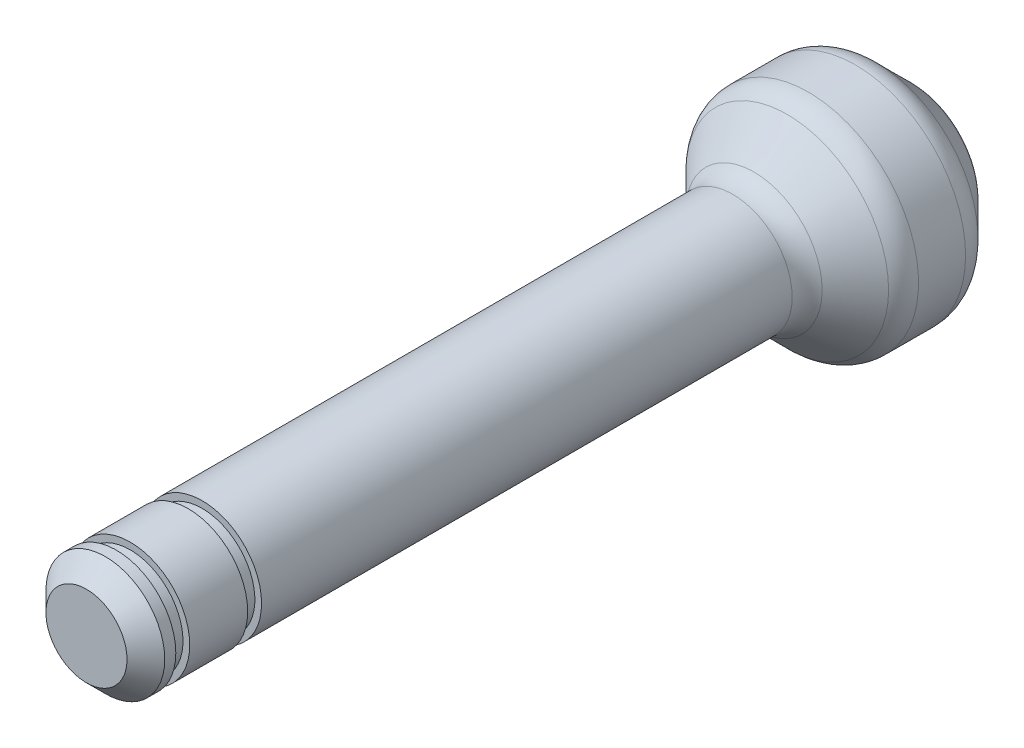
ISO-10303-21;
HEADER;
FILE_DESCRIPTION(('STEP AP214'),'2;1');
FILE_NAME('part.step','',(''),(''),'','','');
FILE_SCHEMA(('AUTOMOTIVE_DESIGN { 1 0 10303 214 1 1 1 1 }'));
ENDSEC;
DATA;
#1=APPLICATION_CONTEXT('core data for automotive mechanical design processes');
#2=APPLICATION_PROTOCOL_DEFINITION('international standard','automotive_design',2000,#1);
#3=PRODUCT_CONTEXT('',#1,'mechanical');
#4=PRODUCT('Part','Part','',(#3));
#5=PRODUCT_RELATED_PRODUCT_CATEGORY('part','',(#4));
#6=PRODUCT_DEFINITION_FORMATION('','',#4);
#7=PRODUCT_DEFINITION_CONTEXT('part definition',#1,'design');
#8=PRODUCT_DEFINITION('design','',#6,#7);
#9=PRODUCT_DEFINITION_SHAPE('','',#8);
#10=(LENGTH_UNIT() NAMED_UNIT(*) SI_UNIT(.MILLI.,.METRE.));
#11=(NAMED_UNIT(*) PLANE_ANGLE_UNIT() SI_UNIT($,.RADIAN.));
#12=(NAMED_UNIT(*) SI_UNIT($,.STERADIAN.) SOLID_ANGLE_UNIT());
#13=UNCERTAINTY_MEASURE_WITH_UNIT(LENGTH_MEASURE(1.E-05),#10,'distance_accuracy_value','');
#14=(GEOMETRIC_REPRESENTATION_CONTEXT(3) GLOBAL_UNCERTAINTY_ASSIGNED_CONTEXT((#13)) GLOBAL_UNIT_ASSIGNED_CONTEXT((#10,
#11,#12)) REPRESENTATION_CONTEXT('',''));
#15=CARTESIAN_POINT('',(0.,0.,0.));
#16=DIRECTION('',(0.,0.,1.));
#17=DIRECTION('',(1.,0.,0.));
#18=AXIS2_PLACEMENT_3D('',#15,#16,#17);
#19=CARTESIAN_POINT('',(0.,3.1496,39.5224));
#20=DIRECTION('',(0.,0.,-1.));
#21=DIRECTION('',(1.,0.,0.));
#22=AXIS2_PLACEMENT_3D('',#19,#20,#21);
#23=PLANE('',#22);
#24=CARTESIAN_POINT('',(0.,0.,39.522399999953));
#25=DIRECTION('',(0.,0.,1.));
#26=DIRECTION('',(1.,0.,0.));
#27=AXIS2_PLACEMENT_3D('',#24,#25,#26);
#28=CIRCLE('',#27,2.14959999988196);
#29=CARTESIAN_POINT('',(2.14959999988196,0.,39.522399999953));
#30=VERTEX_POINT('',#29);
#31=EDGE_CURVE('E119',#30,#30,#28,.T.);
#32=ORIENTED_EDGE('',*,*,#31,.T.);
#33=EDGE_LOOP('',(#32));
#34=FACE_BOUND('',#33,.T.);
#35=ADVANCED_FACE('F37',(#34),#23,.F.);
#36=CARTESIAN_POINT('',(0.,0.,38.5223999999766));
#37=DIRECTION('',(0.,0.,-1.));
#38=DIRECTION('',(1.,0.,0.));
#39=AXIS2_PLACEMENT_3D('',#36,#37,#38);
#40=CONICAL_SURFACE('',#39,3.14959999985831,0.785398163397448);
#41=ORIENTED_EDGE('',*,*,#31,.F.);
#42=EDGE_LOOP('',(#41));
#43=FACE_BOUND('',#42,.T.);
#44=CARTESIAN_POINT('',(0.,0.,38.5224));
#45=DIRECTION('',(0.,0.,1.));
#46=DIRECTION('',(1.,0.,0.));
#47=AXIS2_PLACEMENT_3D('',#44,#45,#46);
#48=CIRCLE('',#47,3.1496);
#49=CARTESIAN_POINT('',(3.1496,0.,38.5224));
#50=VERTEX_POINT('',#49);
#51=EDGE_CURVE('E62',#50,#50,#48,.T.);
#52=ORIENTED_EDGE('',*,*,#51,.T.);
#53=EDGE_LOOP('',(#52));
#54=FACE_BOUND('',#53,.T.);
#55=ADVANCED_FACE('F108',(#43,#54),#40,.T.);
#56=CARTESIAN_POINT('',(0.,0.,-60.9008204406939));
#57=DIRECTION('',(0.,0.,-1.));
#58=DIRECTION('',(1.,0.,0.));
#59=AXIS2_PLACEMENT_3D('',#56,#57,#58);
#60=CYLINDRICAL_SURFACE('',#59,3.1496);
#61=ORIENTED_EDGE('',*,*,#51,.F.);
#62=EDGE_LOOP('',(#61));
#63=FACE_BOUND('',#62,.T.);
#64=CARTESIAN_POINT('',(0.,0.,37.9349));
#65=DIRECTION('',(0.,0.,1.));
#66=DIRECTION('',(1.,0.,0.));
#67=AXIS2_PLACEMENT_3D('',#64,#65,#66);
#68=CIRCLE('',#67,3.1496);
#69=CARTESIAN_POINT('',(3.1496,0.,37.9349));
#70=VERTEX_POINT('',#69);
#71=EDGE_CURVE('E61',#70,#70,#68,.F.);
#72=ORIENTED_EDGE('',*,*,#71,.F.);
#73=EDGE_LOOP('',(#72));
#74=FACE_BOUND('',#73,.T.);
#75=ADVANCED_FACE('F105',(#63,#74),#60,.T.);
#76=CARTESIAN_POINT('',(0.,3.1496,-4.59740000000003));
#77=DIRECTION('',(0.,0.,1.));
#78=DIRECTION('',(-1.,0.,0.));
#79=AXIS2_PLACEMENT_3D('',#76,#77,#78);
#80=PLANE('',#79);
#81=CARTESIAN_POINT('',(0.,0.,-4.59740000000003));
#82=DIRECTION('',(0.,0.,1.));
#83=DIRECTION('',(1.,0.,0.));
#84=AXIS2_PLACEMENT_3D('',#81,#82,#83);
#85=CIRCLE('',#84,2.4920359697327);
#86=CARTESIAN_POINT('',(-2.4920359697327,0.,-4.59740000000003));
#87=VERTEX_POINT('',#86);
#88=CARTESIAN_POINT('',(2.4920359697327,0.,-4.59740000000003));
#89=VERTEX_POINT('',#88);
#90=EDGE_CURVE('E59',#87,#89,#85,.F.);
#91=ORIENTED_EDGE('',*,*,#90,.T.);
#92=CARTESIAN_POINT('',(0.,0.,-4.59740000000003));
#93=DIRECTION('',(0.,0.,1.));
#94=DIRECTION('',(-1.,0.,0.));
#95=AXIS2_PLACEMENT_3D('',#92,#93,#94);
#96=CIRCLE('',#95,2.4920359697327);
#97=EDGE_CURVE('E54',#89,#87,#96,.F.);
#98=ORIENTED_EDGE('',*,*,#97,.T.);
#99=EDGE_LOOP('',(#91,#98));
#100=FACE_BOUND('',#99,.T.);
#101=ADVANCED_FACE('F58',(#100),#80,.F.);
#102=CARTESIAN_POINT('',(0.,2.794,37.9349));
#103=DIRECTION('',(0.,0.,1.));
#104=DIRECTION('',(-1.,0.,0.));
#105=AXIS2_PLACEMENT_3D('',#102,#103,#104);
#106=PLANE('',#105);
#107=CARTESIAN_POINT('',(0.,0.,37.9349));
#108=DIRECTION('',(0.,0.,-1.));
#109=DIRECTION('',(-1.,0.,0.));
#110=AXIS2_PLACEMENT_3D('',#107,#108,#109);
#111=CIRCLE('',#110,2.794);
#112=CARTESIAN_POINT('',(-2.794,0.,37.9349));
#113=VERTEX_POINT('',#112);
#114=EDGE_CURVE('E67',#113,#113,#111,.F.);
#115=ORIENTED_EDGE('',*,*,#114,.T.);
#116=EDGE_LOOP('',(#115));
#117=FACE_BOUND('',#116,.T.);
#118=ORIENTED_EDGE('',*,*,#71,.T.);
#119=EDGE_LOOP('',(#118));
#120=FACE_BOUND('',#119,.T.);
#121=ADVANCED_FACE('F87',(#117,#120),#106,.F.);
#122=CARTESIAN_POINT('',(0.,0.,-3.00990000000003));
#123=DIRECTION('',(0.,0.,1.));
#124=DIRECTION('',(-1.,0.,0.));
#125=AXIS2_PLACEMENT_3D('',#122,#123,#124);
#126=TOROIDAL_SURFACE('',#125,2.4920359697327,1.5875);
#127=CARTESIAN_POINT('',(0.,0.,-4.13243201518299));
#128=DIRECTION('',(0.,0.,-1.));
#129=DIRECTION('',(-1.,0.,0.));
#130=AXIS2_PLACEMENT_3D('',#127,#128,#129);
#131=CIRCLE('',#130,3.6145679848687);
#132=CARTESIAN_POINT('',(-3.6145679848687,0.,-4.13243201518299));
#133=VERTEX_POINT('',#132);
#134=EDGE_CURVE('E93',#133,#133,#131,.T.);
#135=ORIENTED_EDGE('',*,*,#134,.T.);
#136=EDGE_LOOP('',(#135));
#137=FACE_BOUND('',#136,.T.);
#138=ORIENTED_EDGE('',*,*,#90,.F.);
#139=ORIENTED_EDGE('',*,*,#97,.F.);
#140=EDGE_LOOP('',(#138,#139));
#141=FACE_BOUND('',#140,.T.);
#142=ADVANCED_FACE('F66',(#137,#141),#126,.T.);
#143=CARTESIAN_POINT('',(0.,0.,40.0654390361338));
#144=DIRECTION('',(0.,0.,1.));
#145=DIRECTION('',(-1.,0.,0.));
#146=AXIS2_PLACEMENT_3D('',#143,#144,#145);
#147=CYLINDRICAL_SURFACE('',#146,2.794);
#148=ORIENTED_EDGE('',*,*,#114,.F.);
#149=EDGE_LOOP('',(#148));
#150=FACE_BOUND('',#149,.T.);
#151=CARTESIAN_POINT('',(0.,0.,37.1983));
#152=DIRECTION('',(0.,0.,-1.));
#153=DIRECTION('',(-1.,0.,0.));
#154=AXIS2_PLACEMENT_3D('',#151,#152,#153);
#155=CIRCLE('',#154,2.794);
#156=CARTESIAN_POINT('',(-2.794,0.,37.1983));
#157=VERTEX_POINT('',#156);
#158=EDGE_CURVE('E128',#157,#157,#155,.T.);
#159=ORIENTED_EDGE('',*,*,#158,.F.);
#160=EDGE_LOOP('',(#159));
#161=FACE_BOUND('',#160,.T.);
#162=ADVANCED_FACE('F86',(#150,#161),#147,.T.);
#163=CARTESIAN_POINT('',(0.,0.,-2.36996798491873));
#164=DIRECTION('',(0.,0.,1.));
#165=DIRECTION('',(-1.,0.,0.));
#166=AXIS2_PLACEMENT_3D('',#163,#164,#165);
#167=CONICAL_SURFACE('',#166,5.37703201513295,0.785398163381322);
#168=CARTESIAN_POINT('',(0.,0.,-2.36996798486636));
#169=DIRECTION('',(0.,0.,-1.));
#170=DIRECTION('',(-1.,0.,0.));
#171=AXIS2_PLACEMENT_3D('',#168,#169,#170);
#172=CIRCLE('',#171,5.37703201513365);
#173=CARTESIAN_POINT('',(-5.37703201513365,0.,-2.36996798486636));
#174=VERTEX_POINT('',#173);
#175=EDGE_CURVE('E131',#174,#174,#172,.T.);
#176=ORIENTED_EDGE('',*,*,#175,.T.);
#177=EDGE_LOOP('',(#176));
#178=FACE_BOUND('',#177,.T.);
#179=ORIENTED_EDGE('',*,*,#134,.F.);
#180=EDGE_LOOP('',(#179));
#181=FACE_BOUND('',#180,.T.);
#182=ADVANCED_FACE('F192',(#178,#181),#167,.T.);
#183=CARTESIAN_POINT('',(0.,2.794,37.1983));
#184=DIRECTION('',(0.,0.,-1.));
#185=DIRECTION('',(1.,0.,0.));
#186=AXIS2_PLACEMENT_3D('',#183,#184,#185);
#187=PLANE('',#186);
#188=CARTESIAN_POINT('',(0.,0.,37.1983));
#189=DIRECTION('',(0.,0.,1.));
#190=DIRECTION('',(1.,0.,0.));
#191=AXIS2_PLACEMENT_3D('',#188,#189,#190);
#192=CIRCLE('',#191,3.1496);
#193=CARTESIAN_POINT('',(3.1496,0.,37.1983));
#194=VERTEX_POINT('',#193);
#195=EDGE_CURVE('E132',#194,#194,#192,.T.);
#196=ORIENTED_EDGE('',*,*,#195,.T.);
#197=EDGE_LOOP('',(#196));
#198=FACE_BOUND('',#197,.T.);
#199=ORIENTED_EDGE('',*,*,#158,.T.);
#200=EDGE_LOOP('',(#199));
#201=FACE_BOUND('',#200,.T.);
#202=ADVANCED_FACE('F186',(#198,#201),#187,.F.);
#203=CARTESIAN_POINT('',(0.,0.,-1.24743596973272));
#204=DIRECTION('',(0.,0.,1.));
#205=DIRECTION('',(-1.,0.,0.));
#206=AXIS2_PLACEMENT_3D('',#203,#204,#205);
#207=TOROIDAL_SURFACE('',#206,4.2545,1.5875);
#208=CARTESIAN_POINT('',(0.,0.,-1.24743596973272));
#209=DIRECTION('',(0.,0.,1.));
#210=DIRECTION('',(1.,0.,0.));
#211=AXIS2_PLACEMENT_3D('',#208,#209,#210);
#212=CIRCLE('',#211,5.842);
#213=CARTESIAN_POINT('',(5.842,0.,-1.24743596973272));
#214=VERTEX_POINT('',#213);
#215=EDGE_CURVE('E135',#214,#214,#212,.F.);
#216=ORIENTED_EDGE('',*,*,#215,.T.);
#217=EDGE_LOOP('',(#216));
#218=FACE_BOUND('',#217,.T.);
#219=ORIENTED_EDGE('',*,*,#175,.F.);
#220=EDGE_LOOP('',(#219));
#221=FACE_BOUND('',#220,.T.);
#222=ADVANCED_FACE('F181',(#218,#221),#207,.T.);
#223=CARTESIAN_POINT('',(0.,0.,-60.9008204406939));
#224=DIRECTION('',(0.,0.,-1.));
#225=DIRECTION('',(1.,0.,0.));
#226=AXIS2_PLACEMENT_3D('',#223,#224,#225);
#227=CYLINDRICAL_SURFACE('',#226,3.1496);
#228=ORIENTED_EDGE('',*,*,#195,.F.);
#229=EDGE_LOOP('',(#228));
#230=FACE_BOUND('',#229,.T.);
#231=CARTESIAN_POINT('',(0.,0.,34.1249));
#232=DIRECTION('',(0.,0.,1.));
#233=DIRECTION('',(1.,0.,0.));
#234=AXIS2_PLACEMENT_3D('',#231,#232,#233);
#235=CIRCLE('',#234,3.1496);
#236=CARTESIAN_POINT('',(3.1496,0.,34.1249));
#237=VERTEX_POINT('',#236);
#238=EDGE_CURVE('E136',#237,#237,#235,.F.);
#239=ORIENTED_EDGE('',*,*,#238,.F.);
#240=EDGE_LOOP('',(#239));
#241=FACE_BOUND('',#240,.T.);
#242=ADVANCED_FACE('F177',(#230,#241),#227,.T.);
#243=CARTESIAN_POINT('',(0.,0.,-60.9008204406939));
#244=DIRECTION('',(0.,0.,-1.));
#245=DIRECTION('',(1.,0.,0.));
#246=AXIS2_PLACEMENT_3D('',#243,#244,#245);
#247=CYLINDRICAL_SURFACE('',#246,5.842);
#248=ORIENTED_EDGE('',*,*,#215,.F.);
#249=EDGE_LOOP('',(#248));
#250=FACE_BOUND('',#249,.T.);
#251=CARTESIAN_POINT('',(0.,0.,1.24743596973272));
#252=DIRECTION('',(0.,0.,-1.));
#253=DIRECTION('',(-1.,0.,0.));
#254=AXIS2_PLACEMENT_3D('',#251,#252,#253);
#255=CIRCLE('',#254,5.842);
#256=CARTESIAN_POINT('',(-5.842,0.,1.24743596973272));
#257=VERTEX_POINT('',#256);
#258=EDGE_CURVE('E139',#257,#257,#255,.T.);
#259=ORIENTED_EDGE('',*,*,#258,.T.);
#260=EDGE_LOOP('',(#259));
#261=FACE_BOUND('',#260,.T.);
#262=ADVANCED_FACE('F173',(#250,#261),#247,.T.);
#263=CARTESIAN_POINT('',(0.,3.1496,34.1249));
#264=DIRECTION('',(0.,0.,1.));
#265=DIRECTION('',(-1.,0.,0.));
#266=AXIS2_PLACEMENT_3D('',#263,#264,#265);
#267=PLANE('',#266);
#268=CARTESIAN_POINT('',(0.,0.,34.1249));
#269=DIRECTION('',(0.,0.,-1.));
#270=DIRECTION('',(-1.,0.,0.));
#271=AXIS2_PLACEMENT_3D('',#268,#269,#270);
#272=CIRCLE('',#271,2.794);
#273=CARTESIAN_POINT('',(-2.794,0.,34.1249));
#274=VERTEX_POINT('',#273);
#275=EDGE_CURVE('E140',#274,#274,#272,.F.);
#276=ORIENTED_EDGE('',*,*,#275,.T.);
#277=EDGE_LOOP('',(#276));
#278=FACE_BOUND('',#277,.T.);
#279=ORIENTED_EDGE('',*,*,#238,.T.);
#280=EDGE_LOOP('',(#279));
#281=FACE_BOUND('',#280,.T.);
#282=ADVANCED_FACE('F168',(#278,#281),#267,.F.);
#283=CARTESIAN_POINT('',(0.,0.,1.24743596973272));
#284=DIRECTION('',(0.,0.,1.));
#285=DIRECTION('',(-1.,0.,0.));
#286=AXIS2_PLACEMENT_3D('',#283,#284,#285);
#287=TOROIDAL_SURFACE('',#286,4.2545,1.5875);
#288=CARTESIAN_POINT('',(0.,0.,2.36996798486189));
#289=DIRECTION('',(0.,0.,1.));
#290=DIRECTION('',(1.,0.,0.));
#291=AXIS2_PLACEMENT_3D('',#288,#289,#290);
#292=CIRCLE('',#291,5.37703201507611);
#293=CARTESIAN_POINT('',(5.37703201507611,0.,2.36996798486189));
#294=VERTEX_POINT('',#293);
#295=EDGE_CURVE('E143',#294,#294,#292,.F.);
#296=ORIENTED_EDGE('',*,*,#295,.T.);
#297=EDGE_LOOP('',(#296));
#298=FACE_BOUND('',#297,.T.);
#299=ORIENTED_EDGE('',*,*,#258,.F.);
#300=EDGE_LOOP('',(#299));
#301=FACE_BOUND('',#300,.T.);
#302=ADVANCED_FACE('F163',(#298,#301),#287,.T.);
#303=CARTESIAN_POINT('',(0.,0.,40.0654390361338));
#304=DIRECTION('',(0.,0.,1.));
#305=DIRECTION('',(-1.,0.,0.));
#306=AXIS2_PLACEMENT_3D('',#303,#304,#305);
#307=CYLINDRICAL_SURFACE('',#306,2.794);
#308=ORIENTED_EDGE('',*,*,#275,.F.);
#309=EDGE_LOOP('',(#308));
#310=FACE_BOUND('',#309,.T.);
#311=CARTESIAN_POINT('',(0.,0.,33.3883));
#312=DIRECTION('',(0.,0.,-1.));
#313=DIRECTION('',(-1.,0.,0.));
#314=AXIS2_PLACEMENT_3D('',#311,#312,#313);
#315=CIRCLE('',#314,2.794);
#316=CARTESIAN_POINT('',(-2.794,0.,33.3883));
#317=VERTEX_POINT('',#316);
#318=EDGE_CURVE('E144',#317,#317,#315,.T.);
#319=ORIENTED_EDGE('',*,*,#318,.F.);
#320=EDGE_LOOP('',(#319));
#321=FACE_BOUND('',#320,.T.);
#322=ADVANCED_FACE('F167',(#310,#321),#307,.T.);
#323=CARTESIAN_POINT('',(0.,0.,2.36996798486189));
#324=DIRECTION('',(0.,0.,-1.));
#325=DIRECTION('',(1.,0.,0.));
#326=AXIS2_PLACEMENT_3D('',#323,#324,#325);
#327=CONICAL_SURFACE('',#326,5.37703201507611,0.785398163397448);
#328=ORIENTED_EDGE('',*,*,#295,.F.);
#329=EDGE_LOOP('',(#328));
#330=FACE_BOUND('',#329,.T.);
#331=CARTESIAN_POINT('',(0.,0.,4.13243201513368));
#332=DIRECTION('',(0.,0.,1.));
#333=DIRECTION('',(1.,0.,0.));
#334=AXIS2_PLACEMENT_3D('',#331,#332,#333);
#335=CIRCLE('',#334,3.61456798486635);
#336=CARTESIAN_POINT('',(3.61456798486635,0.,4.13243201513368));
#337=VERTEX_POINT('',#336);
#338=EDGE_CURVE('E146',#337,#337,#335,.T.);
#339=ORIENTED_EDGE('',*,*,#338,.F.);
#340=EDGE_LOOP('',(#339));
#341=FACE_BOUND('',#340,.T.);
#342=ADVANCED_FACE('F276',(#330,#341),#327,.T.);
#343=CARTESIAN_POINT('',(0.,3.1496,33.3883));
#344=DIRECTION('',(0.,0.,-1.));
#345=DIRECTION('',(1.,0.,0.));
#346=AXIS2_PLACEMENT_3D('',#343,#344,#345);
#347=PLANE('',#346);
#348=CARTESIAN_POINT('',(0.,0.,33.3883));
#349=DIRECTION('',(0.,0.,1.));
#350=DIRECTION('',(1.,0.,0.));
#351=AXIS2_PLACEMENT_3D('',#348,#349,#350);
#352=CIRCLE('',#351,3.1496);
#353=CARTESIAN_POINT('',(3.1496,0.,33.3883));
#354=VERTEX_POINT('',#353);
#355=EDGE_CURVE('E47',#354,#354,#352,.T.);
#356=ORIENTED_EDGE('',*,*,#355,.T.);
#357=EDGE_LOOP('',(#356));
#358=FACE_BOUND('',#357,.T.);
#359=ORIENTED_EDGE('',*,*,#318,.T.);
#360=EDGE_LOOP('',(#359));
#361=FACE_BOUND('',#360,.T.);
#362=ADVANCED_FACE('F285',(#358,#361),#347,.F.);
#363=CARTESIAN_POINT('',(0.,0.,5.25496403026732));
#364=DIRECTION('',(0.,0.,-1.));
#365=DIRECTION('',(1.,0.,0.));
#366=AXIS2_PLACEMENT_3D('',#363,#364,#365);
#367=TOROIDAL_SURFACE('',#366,4.7371,1.5875);
#368=ORIENTED_EDGE('',*,*,#338,.T.);
#369=EDGE_LOOP('',(#368));
#370=FACE_BOUND('',#369,.T.);
#371=CARTESIAN_POINT('',(0.,0.,5.25496403026732));
#372=DIRECTION('',(0.,0.,1.));
#373=DIRECTION('',(1.,0.,0.));
#374=AXIS2_PLACEMENT_3D('',#371,#372,#373);
#375=CIRCLE('',#374,3.1496);
#376=CARTESIAN_POINT('',(3.1496,0.,5.25496403026732));
#377=VERTEX_POINT('',#376);
#378=EDGE_CURVE('E11',#377,#377,#375,.F.);
#379=ORIENTED_EDGE('',*,*,#378,.T.);
#380=EDGE_LOOP('',(#379));
#381=FACE_BOUND('',#380,.T.);
#382=ADVANCED_FACE('F294',(#370,#381),#367,.F.);
#383=CARTESIAN_POINT('',(0.,0.,-60.9008204406939));
#384=DIRECTION('',(0.,0.,-1.));
#385=DIRECTION('',(1.,0.,0.));
#386=AXIS2_PLACEMENT_3D('',#383,#384,#385);
#387=CYLINDRICAL_SURFACE('',#386,3.1496);
#388=ORIENTED_EDGE('',*,*,#378,.F.);
#389=EDGE_LOOP('',(#388));
#390=FACE_BOUND('',#389,.T.);
#391=ORIENTED_EDGE('',*,*,#355,.F.);
#392=EDGE_LOOP('',(#391));
#393=FACE_BOUND('',#392,.T.);
#394=ADVANCED_FACE('F303',(#390,#393),#387,.T.);
#395=CLOSED_SHELL('',(#35,#55,#75,#101,#121,#142,#162,#182,#202,#222,#242,#262,#282,#302,#322,
#342,#362,#382,#394));
#396=MANIFOLD_SOLID_BREP('B2',#395);
#397=ADVANCED_BREP_SHAPE_REPRESENTATION('',(#18,#396),#14);
#398=SHAPE_DEFINITION_REPRESENTATION(#9,#397);
ENDSEC;
END-ISO-10303-21;
